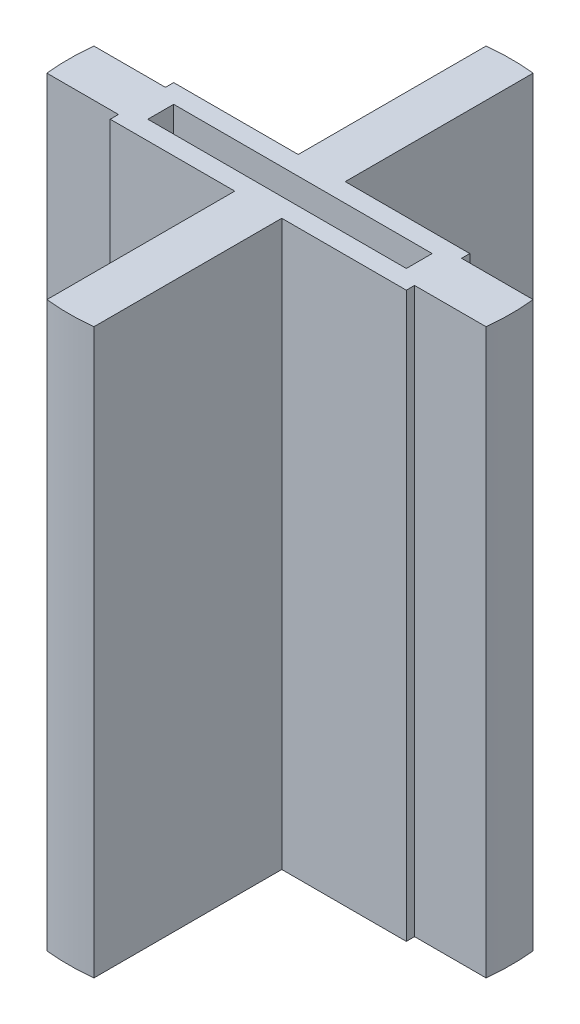
ISO-10303-21;
HEADER;
FILE_DESCRIPTION(('STEP AP214'),'2;1');
FILE_NAME('part.step','',(''),(''),'','','');
FILE_SCHEMA(('AUTOMOTIVE_DESIGN { 1 0 10303 214 1 1 1 1 }'));
ENDSEC;
DATA;
#1=APPLICATION_CONTEXT('core data for automotive mechanical design processes');
#2=APPLICATION_PROTOCOL_DEFINITION('international standard','automotive_design',2000,#1);
#3=PRODUCT_CONTEXT('',#1,'mechanical');
#4=PRODUCT('Part','Part','',(#3));
#5=PRODUCT_RELATED_PRODUCT_CATEGORY('part','',(#4));
#6=PRODUCT_DEFINITION_FORMATION('','',#4);
#7=PRODUCT_DEFINITION_CONTEXT('part definition',#1,'design');
#8=PRODUCT_DEFINITION('design','',#6,#7);
#9=PRODUCT_DEFINITION_SHAPE('','',#8);
#10=(LENGTH_UNIT() NAMED_UNIT(*) SI_UNIT(.MILLI.,.METRE.));
#11=(NAMED_UNIT(*) PLANE_ANGLE_UNIT() SI_UNIT($,.RADIAN.));
#12=(NAMED_UNIT(*) SI_UNIT($,.STERADIAN.) SOLID_ANGLE_UNIT());
#13=UNCERTAINTY_MEASURE_WITH_UNIT(LENGTH_MEASURE(1.E-05),#10,'distance_accuracy_value','');
#14=(GEOMETRIC_REPRESENTATION_CONTEXT(3) GLOBAL_UNCERTAINTY_ASSIGNED_CONTEXT((#13)) GLOBAL_UNIT_ASSIGNED_CONTEXT((#10,
#11,#12)) REPRESENTATION_CONTEXT('',''));
#15=CARTESIAN_POINT('',(0.,0.,0.));
#16=DIRECTION('',(0.,0.,1.));
#17=DIRECTION('',(1.,0.,0.));
#18=AXIS2_PLACEMENT_3D('',#15,#16,#17);
#19=CARTESIAN_POINT('',(34.925,76.2,0.));
#20=DIRECTION('',(-1.,0.,0.));
#21=DIRECTION('',(0.,0.,1.));
#22=AXIS2_PLACEMENT_3D('',#19,#20,#21);
#23=PLANE('',#22);
#24=DIRECTION('',(0.,-1.,0.));
#25=VECTOR('',#24,1.);
#26=CARTESIAN_POINT('',(34.925,76.2,-3.4925));
#27=LINE('',#26,#25);
#28=CARTESIAN_POINT('',(34.925,76.2,-3.4925));
#29=VERTEX_POINT('',#28);
#30=CARTESIAN_POINT('',(34.925,-69.85,-3.4925));
#31=VERTEX_POINT('',#30);
#32=EDGE_CURVE('E217',#29,#31,#27,.T.);
#33=ORIENTED_EDGE('',*,*,#32,.T.);
#34=DIRECTION('',(0.,0.,1.));
#35=VECTOR('',#34,1.);
#36=CARTESIAN_POINT('',(34.925,-69.85,0.));
#37=LINE('',#36,#35);
#38=CARTESIAN_POINT('',(34.925,-69.85,3.4925));
#39=VERTEX_POINT('',#38);
#40=EDGE_CURVE('E61',#31,#39,#37,.T.);
#41=ORIENTED_EDGE('',*,*,#40,.T.);
#42=DIRECTION('',(0.,-1.,0.));
#43=VECTOR('',#42,1.);
#44=CARTESIAN_POINT('',(34.925,76.2,3.4925));
#45=LINE('',#44,#43);
#46=CARTESIAN_POINT('',(34.925,76.2,3.4925));
#47=VERTEX_POINT('',#46);
#48=EDGE_CURVE('E54',#47,#39,#45,.T.);
#49=ORIENTED_EDGE('',*,*,#48,.F.);
#50=DIRECTION('',(0.,0.,-1.));
#51=VECTOR('',#50,1.);
#52=CARTESIAN_POINT('',(34.925,76.2,0.));
#53=LINE('',#52,#51);
#54=EDGE_CURVE('E305',#47,#29,#53,.T.);
#55=ORIENTED_EDGE('',*,*,#54,.T.);
#56=EDGE_LOOP('',(#33,#41,#49,#55));
#57=FACE_BOUND('',#56,.T.);
#58=ADVANCED_FACE('F45',(#57),#23,.T.);
#59=CARTESIAN_POINT('',(0.,76.2,3.4925));
#60=DIRECTION('',(0.,0.,-1.));
#61=DIRECTION('',(-1.,0.,0.));
#62=AXIS2_PLACEMENT_3D('',#59,#60,#61);
#63=PLANE('',#62);
#64=ORIENTED_EDGE('',*,*,#48,.T.);
#65=DIRECTION('',(-1.,0.,0.));
#66=VECTOR('',#65,1.);
#67=CARTESIAN_POINT('',(0.,-69.85,3.4925));
#68=LINE('',#67,#66);
#69=CARTESIAN_POINT('',(-34.925,-69.85,3.4925));
#70=VERTEX_POINT('',#69);
#71=EDGE_CURVE('E68',#39,#70,#68,.T.);
#72=ORIENTED_EDGE('',*,*,#71,.T.);
#73=DIRECTION('',(0.,-1.,0.));
#74=VECTOR('',#73,1.);
#75=CARTESIAN_POINT('',(-34.925,76.2,3.4925));
#76=LINE('',#75,#74);
#77=CARTESIAN_POINT('',(-34.925,76.2,3.4925));
#78=VERTEX_POINT('',#77);
#79=EDGE_CURVE('E216',#78,#70,#76,.T.);
#80=ORIENTED_EDGE('',*,*,#79,.F.);
#81=DIRECTION('',(1.,0.,0.));
#82=VECTOR('',#81,1.);
#83=CARTESIAN_POINT('',(0.,76.2,3.4925));
#84=LINE('',#83,#82);
#85=EDGE_CURVE('E309',#78,#47,#84,.T.);
#86=ORIENTED_EDGE('',*,*,#85,.T.);
#87=EDGE_LOOP('',(#64,#72,#80,#86));
#88=FACE_BOUND('',#87,.T.);
#89=ADVANCED_FACE('F561',(#88),#63,.T.);
#90=CARTESIAN_POINT('',(-34.925,76.2,0.));
#91=DIRECTION('',(-1.,0.,0.));
#92=DIRECTION('',(0.,0.,1.));
#93=AXIS2_PLACEMENT_3D('',#90,#91,#92);
#94=PLANE('',#93);
#95=DIRECTION('',(0.,0.,1.));
#96=VECTOR('',#95,1.);
#97=CARTESIAN_POINT('',(-34.925,-69.85,0.));
#98=LINE('',#97,#96);
#99=CARTESIAN_POINT('',(-34.925,-69.85,-3.4925));
#100=VERTEX_POINT('',#99);
#101=EDGE_CURVE('E220',#100,#70,#98,.T.);
#102=ORIENTED_EDGE('',*,*,#101,.F.);
#103=DIRECTION('',(0.,-1.,0.));
#104=VECTOR('',#103,1.);
#105=CARTESIAN_POINT('',(-34.925,76.2,-3.4925));
#106=LINE('',#105,#104);
#107=CARTESIAN_POINT('',(-34.925,76.2,-3.4925));
#108=VERTEX_POINT('',#107);
#109=EDGE_CURVE('E207',#108,#100,#106,.T.);
#110=ORIENTED_EDGE('',*,*,#109,.F.);
#111=DIRECTION('',(0.,0.,-1.));
#112=VECTOR('',#111,1.);
#113=CARTESIAN_POINT('',(-34.925,76.2,0.));
#114=LINE('',#113,#112);
#115=EDGE_CURVE('E313',#78,#108,#114,.T.);
#116=ORIENTED_EDGE('',*,*,#115,.F.);
#117=ORIENTED_EDGE('',*,*,#79,.T.);
#118=EDGE_LOOP('',(#102,#110,#116,#117));
#119=FACE_BOUND('',#118,.T.);
#120=ADVANCED_FACE('F221',(#119),#94,.F.);
#121=CARTESIAN_POINT('',(0.,76.2,-3.4925));
#122=DIRECTION('',(0.,0.,-1.));
#123=DIRECTION('',(-1.,0.,0.));
#124=AXIS2_PLACEMENT_3D('',#121,#122,#123);
#125=PLANE('',#124);
#126=DIRECTION('',(-1.,0.,0.));
#127=VECTOR('',#126,1.);
#128=CARTESIAN_POINT('',(0.,-69.85,-3.4925));
#129=LINE('',#128,#127);
#130=EDGE_CURVE('E11',#31,#100,#129,.T.);
#131=ORIENTED_EDGE('',*,*,#130,.F.);
#132=ORIENTED_EDGE('',*,*,#32,.F.);
#133=DIRECTION('',(1.,0.,0.));
#134=VECTOR('',#133,1.);
#135=CARTESIAN_POINT('',(0.,76.2,-3.4925));
#136=LINE('',#135,#134);
#137=EDGE_CURVE('E211',#108,#29,#136,.T.);
#138=ORIENTED_EDGE('',*,*,#137,.F.);
#139=ORIENTED_EDGE('',*,*,#109,.T.);
#140=EDGE_LOOP('',(#131,#132,#138,#139));
#141=FACE_BOUND('',#140,.T.);
#142=ADVANCED_FACE('F209',(#141),#125,.F.);
#143=CARTESIAN_POINT('',(0.,76.2,8.5725));
#144=DIRECTION('',(0.,0.,1.));
#145=DIRECTION('',(1.,0.,0.));
#146=AXIS2_PLACEMENT_3D('',#143,#144,#145);
#147=PLANE('',#146);
#148=DIRECTION('',(-1.,0.,0.));
#149=VECTOR('',#148,1.);
#150=CARTESIAN_POINT('',(0.,-76.2,8.5725));
#151=LINE('',#150,#149);
#152=CARTESIAN_POINT('',(-6.35000000000001,-76.2,8.5725));
#153=VERTEX_POINT('',#152);
#154=CARTESIAN_POINT('',(-40.005,-76.2,8.5725));
#155=VERTEX_POINT('',#154);
#156=EDGE_CURVE('E227',#153,#155,#151,.T.);
#157=ORIENTED_EDGE('',*,*,#156,.F.);
#158=DIRECTION('',(0.,-1.,0.));
#159=VECTOR('',#158,1.);
#160=CARTESIAN_POINT('',(-6.35000000000001,76.2,8.5725));
#161=LINE('',#160,#159);
#162=CARTESIAN_POINT('',(-6.35000000000001,76.2,8.5725));
#163=VERTEX_POINT('',#162);
#164=EDGE_CURVE('E390',#163,#153,#161,.T.);
#165=ORIENTED_EDGE('',*,*,#164,.F.);
#166=DIRECTION('',(-1.,0.,0.));
#167=VECTOR('',#166,1.);
#168=CARTESIAN_POINT('',(0.,76.2,8.5725));
#169=LINE('',#168,#167);
#170=CARTESIAN_POINT('',(-40.005,76.2,8.5725));
#171=VERTEX_POINT('',#170);
#172=EDGE_CURVE('E236',#163,#171,#169,.T.);
#173=ORIENTED_EDGE('',*,*,#172,.T.);
#174=DIRECTION('',(0.,-1.,0.));
#175=VECTOR('',#174,1.);
#176=CARTESIAN_POINT('',(-40.005,76.2,8.5725));
#177=LINE('',#176,#175);
#178=EDGE_CURVE('E317',#171,#155,#177,.T.);
#179=ORIENTED_EDGE('',*,*,#178,.T.);
#180=EDGE_LOOP('',(#157,#165,#173,#179));
#181=FACE_BOUND('',#180,.T.);
#182=ADVANCED_FACE('F47',(#181),#147,.T.);
#183=CARTESIAN_POINT('',(-6.35000000000001,76.2,0.));
#184=DIRECTION('',(-1.,0.,0.));
#185=DIRECTION('',(0.,0.,1.));
#186=AXIS2_PLACEMENT_3D('',#183,#184,#185);
#187=PLANE('',#186);
#188=DIRECTION('',(0.,0.,-1.));
#189=VECTOR('',#188,1.);
#190=CARTESIAN_POINT('',(-6.35000000000001,-76.2,0.));
#191=LINE('',#190,#189);
#192=CARTESIAN_POINT('',(-6.35000000000001,-76.2,59.3512729433834));
#193=VERTEX_POINT('',#192);
#194=EDGE_CURVE('E232',#193,#153,#191,.T.);
#195=ORIENTED_EDGE('',*,*,#194,.F.);
#196=DIRECTION('',(0.,-1.,0.));
#197=VECTOR('',#196,1.);
#198=CARTESIAN_POINT('',(-6.35000000000001,76.2,59.3512729433834));
#199=LINE('',#198,#197);
#200=CARTESIAN_POINT('',(-6.35000000000001,76.2,59.3512729433834));
#201=VERTEX_POINT('',#200);
#202=EDGE_CURVE('E453',#201,#193,#199,.T.);
#203=ORIENTED_EDGE('',*,*,#202,.F.);
#204=DIRECTION('',(0.,0.,-1.));
#205=VECTOR('',#204,1.);
#206=CARTESIAN_POINT('',(-6.35000000000001,76.2,0.));
#207=LINE('',#206,#205);
#208=EDGE_CURVE('E240',#201,#163,#207,.T.);
#209=ORIENTED_EDGE('',*,*,#208,.T.);
#210=ORIENTED_EDGE('',*,*,#164,.T.);
#211=EDGE_LOOP('',(#195,#203,#209,#210));
#212=FACE_BOUND('',#211,.T.);
#213=ADVANCED_FACE('F459',(#212),#187,.T.);
#214=CARTESIAN_POINT('',(0.,76.2,0.));
#215=DIRECTION('',(0.,-1.,0.));
#216=DIRECTION('',(0.,0.,-1.));
#217=AXIS2_PLACEMENT_3D('',#214,#215,#216);
#218=CYLINDRICAL_SURFACE('',#217,59.69);
#219=CARTESIAN_POINT('',(0.,-76.2,0.));
#220=DIRECTION('',(0.,1.,0.));
#221=DIRECTION('',(0.,0.,1.));
#222=AXIS2_PLACEMENT_3D('',#219,#220,#221);
#223=CIRCLE('',#222,59.69);
#224=CARTESIAN_POINT('',(6.34999999999999,-76.2,59.3512729433834));
#225=VERTEX_POINT('',#224);
#226=EDGE_CURVE('E322',#193,#225,#223,.T.);
#227=ORIENTED_EDGE('',*,*,#226,.T.);
#228=DIRECTION('',(0.,-1.,0.));
#229=VECTOR('',#228,1.);
#230=CARTESIAN_POINT('',(6.34999999999999,76.2,59.3512729433834));
#231=LINE('',#230,#229);
#232=CARTESIAN_POINT('',(6.34999999999999,76.2,59.3512729433834));
#233=VERTEX_POINT('',#232);
#234=EDGE_CURVE('E449',#233,#225,#231,.T.);
#235=ORIENTED_EDGE('',*,*,#234,.F.);
#236=CARTESIAN_POINT('',(0.,76.2,0.));
#237=DIRECTION('',(0.,1.,0.));
#238=DIRECTION('',(0.,0.,1.));
#239=AXIS2_PLACEMENT_3D('',#236,#237,#238);
#240=CIRCLE('',#239,59.69);
#241=EDGE_CURVE('E245',#201,#233,#240,.T.);
#242=ORIENTED_EDGE('',*,*,#241,.F.);
#243=ORIENTED_EDGE('',*,*,#202,.T.);
#244=EDGE_LOOP('',(#227,#235,#242,#243));
#245=FACE_BOUND('',#244,.T.);
#246=ADVANCED_FACE('F472',(#245),#218,.T.);
#247=CARTESIAN_POINT('',(6.34999999999999,76.2,0.));
#248=DIRECTION('',(-1.,0.,0.));
#249=DIRECTION('',(0.,0.,1.));
#250=AXIS2_PLACEMENT_3D('',#247,#248,#249);
#251=PLANE('',#250);
#252=DIRECTION('',(0.,0.,-1.));
#253=VECTOR('',#252,1.);
#254=CARTESIAN_POINT('',(6.34999999999999,-76.2,0.));
#255=LINE('',#254,#253);
#256=CARTESIAN_POINT('',(6.34999999999999,-76.2,8.5725));
#257=VERTEX_POINT('',#256);
#258=EDGE_CURVE('E325',#225,#257,#255,.T.);
#259=ORIENTED_EDGE('',*,*,#258,.T.);
#260=DIRECTION('',(0.,-1.,0.));
#261=VECTOR('',#260,1.);
#262=CARTESIAN_POINT('',(6.34999999999999,76.2,8.5725));
#263=LINE('',#262,#261);
#264=CARTESIAN_POINT('',(6.34999999999999,76.2,8.5725));
#265=VERTEX_POINT('',#264);
#266=EDGE_CURVE('E446',#265,#257,#263,.T.);
#267=ORIENTED_EDGE('',*,*,#266,.F.);
#268=DIRECTION('',(0.,0.,-1.));
#269=VECTOR('',#268,1.);
#270=CARTESIAN_POINT('',(6.34999999999999,76.2,0.));
#271=LINE('',#270,#269);
#272=EDGE_CURVE('E248',#233,#265,#271,.T.);
#273=ORIENTED_EDGE('',*,*,#272,.F.);
#274=ORIENTED_EDGE('',*,*,#234,.T.);
#275=EDGE_LOOP('',(#259,#267,#273,#274));
#276=FACE_BOUND('',#275,.T.);
#277=ADVANCED_FACE('F476',(#276),#251,.F.);
#278=CARTESIAN_POINT('',(0.,76.2,8.5725));
#279=DIRECTION('',(0.,0.,1.));
#280=DIRECTION('',(1.,0.,0.));
#281=AXIS2_PLACEMENT_3D('',#278,#279,#280);
#282=PLANE('',#281);
#283=DIRECTION('',(-1.,0.,0.));
#284=VECTOR('',#283,1.);
#285=CARTESIAN_POINT('',(0.,-76.2,8.5725));
#286=LINE('',#285,#284);
#287=CARTESIAN_POINT('',(40.005,-76.2,8.5725));
#288=VERTEX_POINT('',#287);
#289=EDGE_CURVE('E329',#288,#257,#286,.T.);
#290=ORIENTED_EDGE('',*,*,#289,.F.);
#291=DIRECTION('',(0.,-1.,0.));
#292=VECTOR('',#291,1.);
#293=CARTESIAN_POINT('',(40.005,76.2,8.5725));
#294=LINE('',#293,#292);
#295=CARTESIAN_POINT('',(40.005,76.2,8.5725));
#296=VERTEX_POINT('',#295);
#297=EDGE_CURVE('E443',#296,#288,#294,.T.);
#298=ORIENTED_EDGE('',*,*,#297,.F.);
#299=DIRECTION('',(-1.,0.,0.));
#300=VECTOR('',#299,1.);
#301=CARTESIAN_POINT('',(0.,76.2,8.5725));
#302=LINE('',#301,#300);
#303=EDGE_CURVE('E251',#296,#265,#302,.T.);
#304=ORIENTED_EDGE('',*,*,#303,.T.);
#305=ORIENTED_EDGE('',*,*,#266,.T.);
#306=EDGE_LOOP('',(#290,#298,#304,#305));
#307=FACE_BOUND('',#306,.T.);
#308=ADVANCED_FACE('F551',(#307),#282,.T.);
#309=CARTESIAN_POINT('',(40.005,76.2,0.));
#310=DIRECTION('',(1.,0.,0.));
#311=DIRECTION('',(0.,0.,-1.));
#312=AXIS2_PLACEMENT_3D('',#309,#310,#311);
#313=PLANE('',#312);
#314=DIRECTION('',(0.,0.,1.));
#315=VECTOR('',#314,1.);
#316=CARTESIAN_POINT('',(40.005,-76.2,0.));
#317=LINE('',#316,#315);
#318=CARTESIAN_POINT('',(40.005,-76.2,6.35));
#319=VERTEX_POINT('',#318);
#320=EDGE_CURVE('E333',#319,#288,#317,.T.);
#321=ORIENTED_EDGE('',*,*,#320,.F.);
#322=DIRECTION('',(0.,-1.,0.));
#323=VECTOR('',#322,1.);
#324=CARTESIAN_POINT('',(40.005,76.2,6.35));
#325=LINE('',#324,#323);
#326=CARTESIAN_POINT('',(40.005,76.2,6.35));
#327=VERTEX_POINT('',#326);
#328=EDGE_CURVE('E440',#327,#319,#325,.T.);
#329=ORIENTED_EDGE('',*,*,#328,.F.);
#330=DIRECTION('',(0.,0.,1.));
#331=VECTOR('',#330,1.);
#332=CARTESIAN_POINT('',(40.005,76.2,0.));
#333=LINE('',#332,#331);
#334=EDGE_CURVE('E255',#327,#296,#333,.T.);
#335=ORIENTED_EDGE('',*,*,#334,.T.);
#336=ORIENTED_EDGE('',*,*,#297,.T.);
#337=EDGE_LOOP('',(#321,#329,#335,#336));
#338=FACE_BOUND('',#337,.T.);
#339=ADVANCED_FACE('F548',(#338),#313,.T.);
#340=CARTESIAN_POINT('',(0.,76.2,6.35));
#341=DIRECTION('',(0.,0.,-1.));
#342=DIRECTION('',(-1.,0.,0.));
#343=AXIS2_PLACEMENT_3D('',#340,#341,#342);
#344=PLANE('',#343);
#345=DIRECTION('',(1.,0.,0.));
#346=VECTOR('',#345,1.);
#347=CARTESIAN_POINT('',(0.,-76.2,6.35));
#348=LINE('',#347,#346);
#349=CARTESIAN_POINT('',(59.3512729433834,-76.2,6.35));
#350=VERTEX_POINT('',#349);
#351=EDGE_CURVE('E337',#319,#350,#348,.T.);
#352=ORIENTED_EDGE('',*,*,#351,.T.);
#353=DIRECTION('',(0.,-1.,0.));
#354=VECTOR('',#353,1.);
#355=CARTESIAN_POINT('',(59.3512729433834,76.2,6.35));
#356=LINE('',#355,#354);
#357=CARTESIAN_POINT('',(59.3512729433834,76.2,6.35));
#358=VERTEX_POINT('',#357);
#359=EDGE_CURVE('E436',#358,#350,#356,.T.);
#360=ORIENTED_EDGE('',*,*,#359,.F.);
#361=DIRECTION('',(1.,0.,0.));
#362=VECTOR('',#361,1.);
#363=CARTESIAN_POINT('',(0.,76.2,6.35));
#364=LINE('',#363,#362);
#365=EDGE_CURVE('E259',#327,#358,#364,.T.);
#366=ORIENTED_EDGE('',*,*,#365,.F.);
#367=ORIENTED_EDGE('',*,*,#328,.T.);
#368=EDGE_LOOP('',(#352,#360,#366,#367));
#369=FACE_BOUND('',#368,.T.);
#370=ADVANCED_FACE('F546',(#369),#344,.F.);
#371=CARTESIAN_POINT('',(0.,76.2,0.));
#372=DIRECTION('',(0.,-1.,0.));
#373=DIRECTION('',(0.,0.,-1.));
#374=AXIS2_PLACEMENT_3D('',#371,#372,#373);
#375=CYLINDRICAL_SURFACE('',#374,59.69);
#376=CARTESIAN_POINT('',(0.,-76.2,0.));
#377=DIRECTION('',(0.,1.,0.));
#378=DIRECTION('',(0.,0.,1.));
#379=AXIS2_PLACEMENT_3D('',#376,#377,#378);
#380=CIRCLE('',#379,59.69);
#381=CARTESIAN_POINT('',(59.3512729433834,-76.2,-6.35));
#382=VERTEX_POINT('',#381);
#383=EDGE_CURVE('E340',#350,#382,#380,.T.);
#384=ORIENTED_EDGE('',*,*,#383,.T.);
#385=DIRECTION('',(0.,-1.,0.));
#386=VECTOR('',#385,1.);
#387=CARTESIAN_POINT('',(59.3512729433834,76.2,-6.35));
#388=LINE('',#387,#386);
#389=CARTESIAN_POINT('',(59.3512729433834,76.2,-6.35));
#390=VERTEX_POINT('',#389);
#391=EDGE_CURVE('E433',#390,#382,#388,.T.);
#392=ORIENTED_EDGE('',*,*,#391,.F.);
#393=CARTESIAN_POINT('',(0.,76.2,0.));
#394=DIRECTION('',(0.,1.,0.));
#395=DIRECTION('',(0.,0.,1.));
#396=AXIS2_PLACEMENT_3D('',#393,#394,#395);
#397=CIRCLE('',#396,59.69);
#398=EDGE_CURVE('E262',#358,#390,#397,.T.);
#399=ORIENTED_EDGE('',*,*,#398,.F.);
#400=ORIENTED_EDGE('',*,*,#359,.T.);
#401=EDGE_LOOP('',(#384,#392,#399,#400));
#402=FACE_BOUND('',#401,.T.);
#403=ADVANCED_FACE('F541',(#402),#375,.T.);
#404=CARTESIAN_POINT('',(0.,76.2,-6.35));
#405=DIRECTION('',(0.,0.,-1.));
#406=DIRECTION('',(-1.,0.,0.));
#407=AXIS2_PLACEMENT_3D('',#404,#405,#406);
#408=PLANE('',#407);
#409=DIRECTION('',(1.,0.,0.));
#410=VECTOR('',#409,1.);
#411=CARTESIAN_POINT('',(0.,-76.2,-6.35));
#412=LINE('',#411,#410);
#413=CARTESIAN_POINT('',(40.005,-76.2,-6.35));
#414=VERTEX_POINT('',#413);
#415=EDGE_CURVE('E344',#414,#382,#412,.T.);
#416=ORIENTED_EDGE('',*,*,#415,.F.);
#417=DIRECTION('',(0.,-1.,0.));
#418=VECTOR('',#417,1.);
#419=CARTESIAN_POINT('',(40.005,76.2,-6.35));
#420=LINE('',#419,#418);
#421=CARTESIAN_POINT('',(40.005,76.2,-6.35));
#422=VERTEX_POINT('',#421);
#423=EDGE_CURVE('E430',#422,#414,#420,.T.);
#424=ORIENTED_EDGE('',*,*,#423,.F.);
#425=DIRECTION('',(1.,0.,0.));
#426=VECTOR('',#425,1.);
#427=CARTESIAN_POINT('',(0.,76.2,-6.35));
#428=LINE('',#427,#426);
#429=EDGE_CURVE('E265',#422,#390,#428,.T.);
#430=ORIENTED_EDGE('',*,*,#429,.T.);
#431=ORIENTED_EDGE('',*,*,#391,.T.);
#432=EDGE_LOOP('',(#416,#424,#430,#431));
#433=FACE_BOUND('',#432,.T.);
#434=ADVANCED_FACE('F535',(#433),#408,.T.);
#435=CARTESIAN_POINT('',(40.005,76.2,0.));
#436=DIRECTION('',(1.,0.,0.));
#437=DIRECTION('',(0.,0.,-1.));
#438=AXIS2_PLACEMENT_3D('',#435,#436,#437);
#439=PLANE('',#438);
#440=DIRECTION('',(0.,0.,1.));
#441=VECTOR('',#440,1.);
#442=CARTESIAN_POINT('',(40.005,-76.2,0.));
#443=LINE('',#442,#441);
#444=CARTESIAN_POINT('',(40.005,-76.2,-8.5725));
#445=VERTEX_POINT('',#444);
#446=EDGE_CURVE('E348',#445,#414,#443,.T.);
#447=ORIENTED_EDGE('',*,*,#446,.F.);
#448=DIRECTION('',(0.,-1.,0.));
#449=VECTOR('',#448,1.);
#450=CARTESIAN_POINT('',(40.005,76.2,-8.5725));
#451=LINE('',#450,#449);
#452=CARTESIAN_POINT('',(40.005,76.2,-8.5725));
#453=VERTEX_POINT('',#452);
#454=EDGE_CURVE('E427',#453,#445,#451,.T.);
#455=ORIENTED_EDGE('',*,*,#454,.F.);
#456=DIRECTION('',(0.,0.,1.));
#457=VECTOR('',#456,1.);
#458=CARTESIAN_POINT('',(40.005,76.2,0.));
#459=LINE('',#458,#457);
#460=EDGE_CURVE('E269',#453,#422,#459,.T.);
#461=ORIENTED_EDGE('',*,*,#460,.T.);
#462=ORIENTED_EDGE('',*,*,#423,.T.);
#463=EDGE_LOOP('',(#447,#455,#461,#462));
#464=FACE_BOUND('',#463,.T.);
#465=ADVANCED_FACE('F530',(#464),#439,.T.);
#466=CARTESIAN_POINT('',(0.,76.2,-8.5725));
#467=DIRECTION('',(0.,0.,1.));
#468=DIRECTION('',(1.,0.,0.));
#469=AXIS2_PLACEMENT_3D('',#466,#467,#468);
#470=PLANE('',#469);
#471=DIRECTION('',(-1.,0.,0.));
#472=VECTOR('',#471,1.);
#473=CARTESIAN_POINT('',(0.,-76.2,-8.5725));
#474=LINE('',#473,#472);
#475=CARTESIAN_POINT('',(6.34999999999999,-76.2,-8.5725));
#476=VERTEX_POINT('',#475);
#477=EDGE_CURVE('E352',#445,#476,#474,.T.);
#478=ORIENTED_EDGE('',*,*,#477,.T.);
#479=DIRECTION('',(0.,-1.,0.));
#480=VECTOR('',#479,1.);
#481=CARTESIAN_POINT('',(6.34999999999999,76.2,-8.5725));
#482=LINE('',#481,#480);
#483=CARTESIAN_POINT('',(6.34999999999999,76.2,-8.5725));
#484=VERTEX_POINT('',#483);
#485=EDGE_CURVE('E424',#484,#476,#482,.T.);
#486=ORIENTED_EDGE('',*,*,#485,.F.);
#487=DIRECTION('',(-1.,0.,0.));
#488=VECTOR('',#487,1.);
#489=CARTESIAN_POINT('',(0.,76.2,-8.5725));
#490=LINE('',#489,#488);
#491=EDGE_CURVE('E273',#453,#484,#490,.T.);
#492=ORIENTED_EDGE('',*,*,#491,.F.);
#493=ORIENTED_EDGE('',*,*,#454,.T.);
#494=EDGE_LOOP('',(#478,#486,#492,#493));
#495=FACE_BOUND('',#494,.T.);
#496=ADVANCED_FACE('F527',(#495),#470,.F.);
#497=CARTESIAN_POINT('',(6.34999999999999,76.2,0.));
#498=DIRECTION('',(-1.,0.,0.));
#499=DIRECTION('',(0.,0.,1.));
#500=AXIS2_PLACEMENT_3D('',#497,#498,#499);
#501=PLANE('',#500);
#502=DIRECTION('',(0.,0.,-1.));
#503=VECTOR('',#502,1.);
#504=CARTESIAN_POINT('',(6.34999999999999,-76.2,0.));
#505=LINE('',#504,#503);
#506=CARTESIAN_POINT('',(6.34999999999999,-76.2,-59.3512729433834));
#507=VERTEX_POINT('',#506);
#508=EDGE_CURVE('E356',#476,#507,#505,.T.);
#509=ORIENTED_EDGE('',*,*,#508,.T.);
#510=DIRECTION('',(0.,-1.,0.));
#511=VECTOR('',#510,1.);
#512=CARTESIAN_POINT('',(6.34999999999999,76.2,-59.3512729433834));
#513=LINE('',#512,#511);
#514=CARTESIAN_POINT('',(6.34999999999999,76.2,-59.3512729433834));
#515=VERTEX_POINT('',#514);
#516=EDGE_CURVE('E420',#515,#507,#513,.T.);
#517=ORIENTED_EDGE('',*,*,#516,.F.);
#518=DIRECTION('',(0.,0.,-1.));
#519=VECTOR('',#518,1.);
#520=CARTESIAN_POINT('',(6.34999999999999,76.2,0.));
#521=LINE('',#520,#519);
#522=EDGE_CURVE('E276',#484,#515,#521,.T.);
#523=ORIENTED_EDGE('',*,*,#522,.F.);
#524=ORIENTED_EDGE('',*,*,#485,.T.);
#525=EDGE_LOOP('',(#509,#517,#523,#524));
#526=FACE_BOUND('',#525,.T.);
#527=ADVANCED_FACE('F523',(#526),#501,.F.);
#528=CARTESIAN_POINT('',(0.,76.2,0.));
#529=DIRECTION('',(0.,-1.,0.));
#530=DIRECTION('',(0.,0.,-1.));
#531=AXIS2_PLACEMENT_3D('',#528,#529,#530);
#532=CYLINDRICAL_SURFACE('',#531,59.69);
#533=CARTESIAN_POINT('',(0.,-76.2,0.));
#534=DIRECTION('',(0.,1.,0.));
#535=DIRECTION('',(0.,0.,1.));
#536=AXIS2_PLACEMENT_3D('',#533,#534,#535);
#537=CIRCLE('',#536,59.69);
#538=CARTESIAN_POINT('',(-6.35000000000001,-76.2,-59.3512729433834));
#539=VERTEX_POINT('',#538);
#540=EDGE_CURVE('E359',#507,#539,#537,.T.);
#541=ORIENTED_EDGE('',*,*,#540,.T.);
#542=DIRECTION('',(0.,-1.,0.));
#543=VECTOR('',#542,1.);
#544=CARTESIAN_POINT('',(-6.35000000000001,76.2,-59.3512729433834));
#545=LINE('',#544,#543);
#546=CARTESIAN_POINT('',(-6.35000000000001,76.2,-59.3512729433834));
#547=VERTEX_POINT('',#546);
#548=EDGE_CURVE('E417',#547,#539,#545,.T.);
#549=ORIENTED_EDGE('',*,*,#548,.F.);
#550=CARTESIAN_POINT('',(0.,76.2,0.));
#551=DIRECTION('',(0.,1.,0.));
#552=DIRECTION('',(0.,0.,1.));
#553=AXIS2_PLACEMENT_3D('',#550,#551,#552);
#554=CIRCLE('',#553,59.69);
#555=EDGE_CURVE('E279',#515,#547,#554,.T.);
#556=ORIENTED_EDGE('',*,*,#555,.F.);
#557=ORIENTED_EDGE('',*,*,#516,.T.);
#558=EDGE_LOOP('',(#541,#549,#556,#557));
#559=FACE_BOUND('',#558,.T.);
#560=ADVANCED_FACE('F518',(#559),#532,.T.);
#561=CARTESIAN_POINT('',(-6.35000000000001,76.2,0.));
#562=DIRECTION('',(-1.,0.,0.));
#563=DIRECTION('',(0.,0.,1.));
#564=AXIS2_PLACEMENT_3D('',#561,#562,#563);
#565=PLANE('',#564);
#566=DIRECTION('',(0.,0.,-1.));
#567=VECTOR('',#566,1.);
#568=CARTESIAN_POINT('',(-6.35000000000001,-76.2,0.));
#569=LINE('',#568,#567);
#570=CARTESIAN_POINT('',(-6.35000000000001,-76.2,-8.5725));
#571=VERTEX_POINT('',#570);
#572=EDGE_CURVE('E363',#571,#539,#569,.T.);
#573=ORIENTED_EDGE('',*,*,#572,.F.);
#574=DIRECTION('',(0.,-1.,0.));
#575=VECTOR('',#574,1.);
#576=CARTESIAN_POINT('',(-6.35000000000001,76.2,-8.5725));
#577=LINE('',#576,#575);
#578=CARTESIAN_POINT('',(-6.35000000000001,76.2,-8.5725));
#579=VERTEX_POINT('',#578);
#580=EDGE_CURVE('E414',#579,#571,#577,.T.);
#581=ORIENTED_EDGE('',*,*,#580,.F.);
#582=DIRECTION('',(0.,0.,-1.));
#583=VECTOR('',#582,1.);
#584=CARTESIAN_POINT('',(-6.35000000000001,76.2,0.));
#585=LINE('',#584,#583);
#586=EDGE_CURVE('E282',#579,#547,#585,.T.);
#587=ORIENTED_EDGE('',*,*,#586,.T.);
#588=ORIENTED_EDGE('',*,*,#548,.T.);
#589=EDGE_LOOP('',(#573,#581,#587,#588));
#590=FACE_BOUND('',#589,.T.);
#591=ADVANCED_FACE('F513',(#590),#565,.T.);
#592=CARTESIAN_POINT('',(0.,76.2,-8.5725));
#593=DIRECTION('',(0.,0.,1.));
#594=DIRECTION('',(1.,0.,0.));
#595=AXIS2_PLACEMENT_3D('',#592,#593,#594);
#596=PLANE('',#595);
#597=DIRECTION('',(-1.,0.,0.));
#598=VECTOR('',#597,1.);
#599=CARTESIAN_POINT('',(0.,-76.2,-8.5725));
#600=LINE('',#599,#598);
#601=CARTESIAN_POINT('',(-40.005,-76.2,-8.5725));
#602=VERTEX_POINT('',#601);
#603=EDGE_CURVE('E367',#571,#602,#600,.T.);
#604=ORIENTED_EDGE('',*,*,#603,.T.);
#605=DIRECTION('',(0.,-1.,0.));
#606=VECTOR('',#605,1.);
#607=CARTESIAN_POINT('',(-40.005,76.2,-8.5725));
#608=LINE('',#607,#606);
#609=CARTESIAN_POINT('',(-40.005,76.2,-8.5725));
#610=VERTEX_POINT('',#609);
#611=EDGE_CURVE('E411',#610,#602,#608,.T.);
#612=ORIENTED_EDGE('',*,*,#611,.F.);
#613=DIRECTION('',(-1.,0.,0.));
#614=VECTOR('',#613,1.);
#615=CARTESIAN_POINT('',(0.,76.2,-8.5725));
#616=LINE('',#615,#614);
#617=EDGE_CURVE('E286',#579,#610,#616,.T.);
#618=ORIENTED_EDGE('',*,*,#617,.F.);
#619=ORIENTED_EDGE('',*,*,#580,.T.);
#620=EDGE_LOOP('',(#604,#612,#618,#619));
#621=FACE_BOUND('',#620,.T.);
#622=ADVANCED_FACE('F510',(#621),#596,.F.);
#623=CARTESIAN_POINT('',(-40.005,76.2,0.));
#624=DIRECTION('',(1.,0.,0.));
#625=DIRECTION('',(0.,0.,-1.));
#626=AXIS2_PLACEMENT_3D('',#623,#624,#625);
#627=PLANE('',#626);
#628=DIRECTION('',(0.,0.,1.));
#629=VECTOR('',#628,1.);
#630=CARTESIAN_POINT('',(-40.005,-76.2,0.));
#631=LINE('',#630,#629);
#632=CARTESIAN_POINT('',(-40.005,-76.2,-6.35));
#633=VERTEX_POINT('',#632);
#634=EDGE_CURVE('E371',#602,#633,#631,.T.);
#635=ORIENTED_EDGE('',*,*,#634,.T.);
#636=DIRECTION('',(0.,-1.,0.));
#637=VECTOR('',#636,1.);
#638=CARTESIAN_POINT('',(-40.005,76.2,-6.35));
#639=LINE('',#638,#637);
#640=CARTESIAN_POINT('',(-40.005,76.2,-6.35));
#641=VERTEX_POINT('',#640);
#642=EDGE_CURVE('E408',#641,#633,#639,.T.);
#643=ORIENTED_EDGE('',*,*,#642,.F.);
#644=DIRECTION('',(0.,0.,1.));
#645=VECTOR('',#644,1.);
#646=CARTESIAN_POINT('',(-40.005,76.2,0.));
#647=LINE('',#646,#645);
#648=EDGE_CURVE('E289',#610,#641,#647,.T.);
#649=ORIENTED_EDGE('',*,*,#648,.F.);
#650=ORIENTED_EDGE('',*,*,#611,.T.);
#651=EDGE_LOOP('',(#635,#643,#649,#650));
#652=FACE_BOUND('',#651,.T.);
#653=ADVANCED_FACE('F505',(#652),#627,.F.);
#654=CARTESIAN_POINT('',(0.,76.2,-6.35));
#655=DIRECTION('',(0.,0.,-1.));
#656=DIRECTION('',(-1.,0.,0.));
#657=AXIS2_PLACEMENT_3D('',#654,#655,#656);
#658=PLANE('',#657);
#659=DIRECTION('',(1.,0.,0.));
#660=VECTOR('',#659,1.);
#661=CARTESIAN_POINT('',(0.,-76.2,-6.35));
#662=LINE('',#661,#660);
#663=CARTESIAN_POINT('',(-59.3512729433834,-76.2,-6.35));
#664=VERTEX_POINT('',#663);
#665=EDGE_CURVE('E375',#664,#633,#662,.T.);
#666=ORIENTED_EDGE('',*,*,#665,.F.);
#667=DIRECTION('',(0.,-1.,0.));
#668=VECTOR('',#667,1.);
#669=CARTESIAN_POINT('',(-59.3512729433834,76.2,-6.35));
#670=LINE('',#669,#668);
#671=CARTESIAN_POINT('',(-59.3512729433834,76.2,-6.35));
#672=VERTEX_POINT('',#671);
#673=EDGE_CURVE('E405',#672,#664,#670,.T.);
#674=ORIENTED_EDGE('',*,*,#673,.F.);
#675=DIRECTION('',(1.,0.,0.));
#676=VECTOR('',#675,1.);
#677=CARTESIAN_POINT('',(0.,76.2,-6.35));
#678=LINE('',#677,#676);
#679=EDGE_CURVE('E292',#672,#641,#678,.T.);
#680=ORIENTED_EDGE('',*,*,#679,.T.);
#681=ORIENTED_EDGE('',*,*,#642,.T.);
#682=EDGE_LOOP('',(#666,#674,#680,#681));
#683=FACE_BOUND('',#682,.T.);
#684=ADVANCED_FACE('F499',(#683),#658,.T.);
#685=CARTESIAN_POINT('',(0.,76.2,0.));
#686=DIRECTION('',(0.,-1.,0.));
#687=DIRECTION('',(0.,0.,-1.));
#688=AXIS2_PLACEMENT_3D('',#685,#686,#687);
#689=CYLINDRICAL_SURFACE('',#688,59.69);
#690=CARTESIAN_POINT('',(0.,-76.2,0.));
#691=DIRECTION('',(0.,1.,0.));
#692=DIRECTION('',(0.,0.,1.));
#693=AXIS2_PLACEMENT_3D('',#690,#691,#692);
#694=CIRCLE('',#693,59.69);
#695=CARTESIAN_POINT('',(-59.3512729433834,-76.2,6.35));
#696=VERTEX_POINT('',#695);
#697=EDGE_CURVE('E379',#664,#696,#694,.T.);
#698=ORIENTED_EDGE('',*,*,#697,.T.);
#699=DIRECTION('',(0.,-1.,0.));
#700=VECTOR('',#699,1.);
#701=CARTESIAN_POINT('',(-59.3512729433834,76.2,6.35));
#702=LINE('',#701,#700);
#703=CARTESIAN_POINT('',(-59.3512729433834,76.2,6.35));
#704=VERTEX_POINT('',#703);
#705=EDGE_CURVE('E401',#704,#696,#702,.T.);
#706=ORIENTED_EDGE('',*,*,#705,.F.);
#707=CARTESIAN_POINT('',(0.,76.2,0.));
#708=DIRECTION('',(0.,1.,0.));
#709=DIRECTION('',(0.,0.,1.));
#710=AXIS2_PLACEMENT_3D('',#707,#708,#709);
#711=CIRCLE('',#710,59.69);
#712=EDGE_CURVE('E296',#672,#704,#711,.T.);
#713=ORIENTED_EDGE('',*,*,#712,.F.);
#714=ORIENTED_EDGE('',*,*,#673,.T.);
#715=EDGE_LOOP('',(#698,#706,#713,#714));
#716=FACE_BOUND('',#715,.T.);
#717=ADVANCED_FACE('F496',(#716),#689,.T.);
#718=CARTESIAN_POINT('',(0.,76.2,6.35));
#719=DIRECTION('',(0.,0.,-1.));
#720=DIRECTION('',(-1.,0.,0.));
#721=AXIS2_PLACEMENT_3D('',#718,#719,#720);
#722=PLANE('',#721);
#723=DIRECTION('',(1.,0.,0.));
#724=VECTOR('',#723,1.);
#725=CARTESIAN_POINT('',(0.,-76.2,6.35));
#726=LINE('',#725,#724);
#727=CARTESIAN_POINT('',(-40.005,-76.2,6.35));
#728=VERTEX_POINT('',#727);
#729=EDGE_CURVE('E382',#696,#728,#726,.T.);
#730=ORIENTED_EDGE('',*,*,#729,.T.);
#731=DIRECTION('',(0.,-1.,0.));
#732=VECTOR('',#731,1.);
#733=CARTESIAN_POINT('',(-40.005,76.2,6.35));
#734=LINE('',#733,#732);
#735=CARTESIAN_POINT('',(-40.005,76.2,6.35));
#736=VERTEX_POINT('',#735);
#737=EDGE_CURVE('E398',#736,#728,#734,.T.);
#738=ORIENTED_EDGE('',*,*,#737,.F.);
#739=DIRECTION('',(1.,0.,0.));
#740=VECTOR('',#739,1.);
#741=CARTESIAN_POINT('',(0.,76.2,6.35));
#742=LINE('',#741,#740);
#743=EDGE_CURVE('E299',#704,#736,#742,.T.);
#744=ORIENTED_EDGE('',*,*,#743,.F.);
#745=ORIENTED_EDGE('',*,*,#705,.T.);
#746=EDGE_LOOP('',(#730,#738,#744,#745));
#747=FACE_BOUND('',#746,.T.);
#748=ADVANCED_FACE('F492',(#747),#722,.F.);
#749=CARTESIAN_POINT('',(-40.005,76.2,0.));
#750=DIRECTION('',(1.,0.,0.));
#751=DIRECTION('',(0.,0.,-1.));
#752=AXIS2_PLACEMENT_3D('',#749,#750,#751);
#753=PLANE('',#752);
#754=DIRECTION('',(0.,0.,1.));
#755=VECTOR('',#754,1.);
#756=CARTESIAN_POINT('',(-40.005,-76.2,0.));
#757=LINE('',#756,#755);
#758=EDGE_CURVE('E241',#728,#155,#757,.T.);
#759=ORIENTED_EDGE('',*,*,#758,.T.);
#760=ORIENTED_EDGE('',*,*,#178,.F.);
#761=DIRECTION('',(0.,0.,1.));
#762=VECTOR('',#761,1.);
#763=CARTESIAN_POINT('',(-40.005,76.2,0.));
#764=LINE('',#763,#762);
#765=EDGE_CURVE('E302',#736,#171,#764,.T.);
#766=ORIENTED_EDGE('',*,*,#765,.F.);
#767=ORIENTED_EDGE('',*,*,#737,.T.);
#768=EDGE_LOOP('',(#759,#760,#766,#767));
#769=FACE_BOUND('',#768,.T.);
#770=ADVANCED_FACE('F487',(#769),#753,.F.);
#771=CARTESIAN_POINT('',(0.,76.2,0.));
#772=DIRECTION('',(0.,1.,0.));
#773=DIRECTION('',(0.,0.,1.));
#774=AXIS2_PLACEMENT_3D('',#771,#772,#773);
#775=PLANE('',#774);
#776=ORIENTED_EDGE('',*,*,#172,.F.);
#777=ORIENTED_EDGE('',*,*,#208,.F.);
#778=ORIENTED_EDGE('',*,*,#241,.T.);
#779=ORIENTED_EDGE('',*,*,#272,.T.);
#780=ORIENTED_EDGE('',*,*,#303,.F.);
#781=ORIENTED_EDGE('',*,*,#334,.F.);
#782=ORIENTED_EDGE('',*,*,#365,.T.);
#783=ORIENTED_EDGE('',*,*,#398,.T.);
#784=ORIENTED_EDGE('',*,*,#429,.F.);
#785=ORIENTED_EDGE('',*,*,#460,.F.);
#786=ORIENTED_EDGE('',*,*,#491,.T.);
#787=ORIENTED_EDGE('',*,*,#522,.T.);
#788=ORIENTED_EDGE('',*,*,#555,.T.);
#789=ORIENTED_EDGE('',*,*,#586,.F.);
#790=ORIENTED_EDGE('',*,*,#617,.T.);
#791=ORIENTED_EDGE('',*,*,#648,.T.);
#792=ORIENTED_EDGE('',*,*,#679,.F.);
#793=ORIENTED_EDGE('',*,*,#712,.T.);
#794=ORIENTED_EDGE('',*,*,#743,.T.);
#795=ORIENTED_EDGE('',*,*,#765,.T.);
#796=EDGE_LOOP('',(#776,#777,#778,#779,#780,#781,#782,#783,#784,#785,#786,#787,#788,#789,#790,
#791,#792,#793,#794,#795));
#797=FACE_BOUND('',#796,.T.);
#798=ORIENTED_EDGE('',*,*,#54,.F.);
#799=ORIENTED_EDGE('',*,*,#85,.F.);
#800=ORIENTED_EDGE('',*,*,#115,.T.);
#801=ORIENTED_EDGE('',*,*,#137,.T.);
#802=EDGE_LOOP('',(#798,#799,#800,#801));
#803=FACE_BOUND('',#802,.T.);
#804=ADVANCED_FACE('F480',(#797,#803),#775,.T.);
#805=CARTESIAN_POINT('',(0.,-76.2,0.));
#806=DIRECTION('',(0.,1.,0.));
#807=DIRECTION('',(0.,0.,1.));
#808=AXIS2_PLACEMENT_3D('',#805,#806,#807);
#809=PLANE('',#808);
#810=ORIENTED_EDGE('',*,*,#508,.F.);
#811=ORIENTED_EDGE('',*,*,#477,.F.);
#812=ORIENTED_EDGE('',*,*,#446,.T.);
#813=ORIENTED_EDGE('',*,*,#415,.T.);
#814=ORIENTED_EDGE('',*,*,#383,.F.);
#815=ORIENTED_EDGE('',*,*,#351,.F.);
#816=ORIENTED_EDGE('',*,*,#320,.T.);
#817=ORIENTED_EDGE('',*,*,#289,.T.);
#818=ORIENTED_EDGE('',*,*,#258,.F.);
#819=ORIENTED_EDGE('',*,*,#226,.F.);
#820=ORIENTED_EDGE('',*,*,#194,.T.);
#821=ORIENTED_EDGE('',*,*,#156,.T.);
#822=ORIENTED_EDGE('',*,*,#758,.F.);
#823=ORIENTED_EDGE('',*,*,#729,.F.);
#824=ORIENTED_EDGE('',*,*,#697,.F.);
#825=ORIENTED_EDGE('',*,*,#665,.T.);
#826=ORIENTED_EDGE('',*,*,#634,.F.);
#827=ORIENTED_EDGE('',*,*,#603,.F.);
#828=ORIENTED_EDGE('',*,*,#572,.T.);
#829=ORIENTED_EDGE('',*,*,#540,.F.);
#830=EDGE_LOOP('',(#810,#811,#812,#813,#814,#815,#816,#817,#818,#819,#820,#821,#822,#823,#824,
#825,#826,#827,#828,#829));
#831=FACE_BOUND('',#830,.T.);
#832=ADVANCED_FACE('F468',(#831),#809,.F.);
#833=CARTESIAN_POINT('',(0.,-69.85,0.));
#834=DIRECTION('',(0.,-1.,0.));
#835=DIRECTION('',(0.,0.,-1.));
#836=AXIS2_PLACEMENT_3D('',#833,#834,#835);
#837=PLANE('',#836);
#838=ORIENTED_EDGE('',*,*,#40,.F.);
#839=ORIENTED_EDGE('',*,*,#130,.T.);
#840=ORIENTED_EDGE('',*,*,#101,.T.);
#841=ORIENTED_EDGE('',*,*,#71,.F.);
#842=EDGE_LOOP('',(#838,#839,#840,#841));
#843=FACE_BOUND('',#842,.T.);
#844=ADVANCED_FACE('F225',(#843),#837,.F.);
#845=CLOSED_SHELL('',(#58,#89,#120,#142,#182,#213,#246,#277,#308,#339,#370,#403,#434,#465,#496,
#527,#560,#591,#622,#653,#684,#717,#748,#770,#804,#832,#844));
#846=MANIFOLD_SOLID_BREP('B2',#845);
#847=ADVANCED_BREP_SHAPE_REPRESENTATION('',(#18,#846),#14);
#848=SHAPE_DEFINITION_REPRESENTATION(#9,#847);
ENDSEC;
END-ISO-10303-21;
